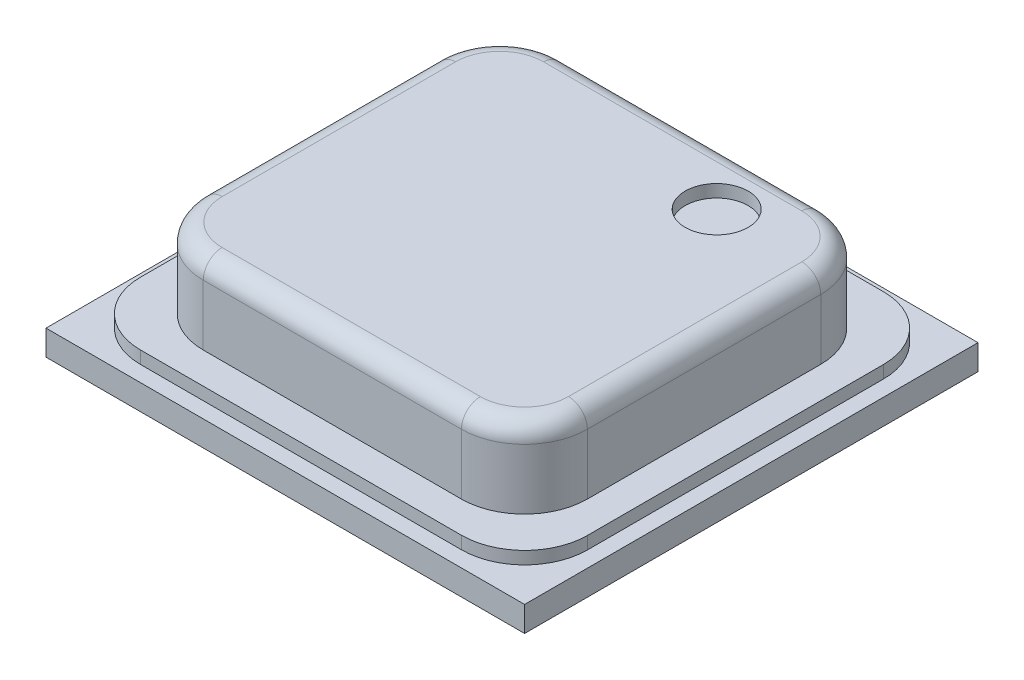
ISO-10303-21;
HEADER;
FILE_DESCRIPTION(('STEP AP214'),'2;1');
FILE_NAME('part.step','',(''),(''),'','','');
FILE_SCHEMA(('AUTOMOTIVE_DESIGN { 1 0 10303 214 1 1 1 1 }'));
ENDSEC;
DATA;
#1=APPLICATION_CONTEXT('core data for automotive mechanical design processes');
#2=APPLICATION_PROTOCOL_DEFINITION('international standard','automotive_design',2000,#1);
#3=PRODUCT_CONTEXT('',#1,'mechanical');
#4=PRODUCT('Part','Part','',(#3));
#5=PRODUCT_RELATED_PRODUCT_CATEGORY('part','',(#4));
#6=PRODUCT_DEFINITION_FORMATION('','',#4);
#7=PRODUCT_DEFINITION_CONTEXT('part definition',#1,'design');
#8=PRODUCT_DEFINITION('design','',#6,#7);
#9=PRODUCT_DEFINITION_SHAPE('','',#8);
#10=(LENGTH_UNIT() NAMED_UNIT(*) SI_UNIT(.MILLI.,.METRE.));
#11=(NAMED_UNIT(*) PLANE_ANGLE_UNIT() SI_UNIT($,.RADIAN.));
#12=(NAMED_UNIT(*) SI_UNIT($,.STERADIAN.) SOLID_ANGLE_UNIT());
#13=UNCERTAINTY_MEASURE_WITH_UNIT(LENGTH_MEASURE(1.E-05),#10,'distance_accuracy_value','');
#14=(GEOMETRIC_REPRESENTATION_CONTEXT(3) GLOBAL_UNCERTAINTY_ASSIGNED_CONTEXT((#13)) GLOBAL_UNIT_ASSIGNED_CONTEXT((#10,
#11,#12)) REPRESENTATION_CONTEXT('',''));
#15=CARTESIAN_POINT('',(0.,0.,0.));
#16=DIRECTION('',(0.,0.,1.));
#17=DIRECTION('',(1.,0.,0.));
#18=AXIS2_PLACEMENT_3D('',#15,#16,#17);
#19=CARTESIAN_POINT('',(0.,0.3,0.));
#20=DIRECTION('',(0.,1.,0.));
#21=DIRECTION('',(0.,0.,1.));
#22=AXIS2_PLACEMENT_3D('',#19,#20,#21);
#23=PLANE('',#22);
#24=DIRECTION('',(1.,0.,0.));
#25=VECTOR('',#24,1.);
#26=CARTESIAN_POINT('',(-1.775,0.3,1.675));
#27=LINE('',#26,#25);
#28=CARTESIAN_POINT('',(-1.275,0.3,1.675));
#29=VERTEX_POINT('',#28);
#30=CARTESIAN_POINT('',(1.275,0.3,1.675));
#31=VERTEX_POINT('',#30);
#32=EDGE_CURVE('E376',#29,#31,#27,.T.);
#33=ORIENTED_EDGE('',*,*,#32,.T.);
#34=CARTESIAN_POINT('',(1.275,0.3,1.175));
#35=DIRECTION('',(0.,1.,0.));
#36=DIRECTION('',(0.,0.,1.));
#37=AXIS2_PLACEMENT_3D('',#34,#35,#36);
#38=CIRCLE('',#37,0.5);
#39=CARTESIAN_POINT('',(1.775,0.3,1.175));
#40=VERTEX_POINT('',#39);
#41=EDGE_CURVE('E245',#31,#40,#38,.T.);
#42=ORIENTED_EDGE('',*,*,#41,.T.);
#43=DIRECTION('',(0.,0.,-1.));
#44=VECTOR('',#43,1.);
#45=CARTESIAN_POINT('',(1.775,0.3,-1.675));
#46=LINE('',#45,#44);
#47=CARTESIAN_POINT('',(1.775,0.3,-1.175));
#48=VERTEX_POINT('',#47);
#49=EDGE_CURVE('E366',#40,#48,#46,.T.);
#50=ORIENTED_EDGE('',*,*,#49,.T.);
#51=CARTESIAN_POINT('',(1.275,0.3,-1.175));
#52=DIRECTION('',(0.,1.,0.));
#53=DIRECTION('',(0.,0.,1.));
#54=AXIS2_PLACEMENT_3D('',#51,#52,#53);
#55=CIRCLE('',#54,0.5);
#56=CARTESIAN_POINT('',(1.275,0.3,-1.675));
#57=VERTEX_POINT('',#56);
#58=EDGE_CURVE('E243',#48,#57,#55,.T.);
#59=ORIENTED_EDGE('',*,*,#58,.T.);
#60=DIRECTION('',(-1.,0.,0.));
#61=VECTOR('',#60,1.);
#62=CARTESIAN_POINT('',(-1.775,0.3,-1.675));
#63=LINE('',#62,#61);
#64=CARTESIAN_POINT('',(-1.275,0.3,-1.675));
#65=VERTEX_POINT('',#64);
#66=EDGE_CURVE('E369',#57,#65,#63,.T.);
#67=ORIENTED_EDGE('',*,*,#66,.T.);
#68=CARTESIAN_POINT('',(-1.275,0.3,-1.175));
#69=DIRECTION('',(0.,1.,0.));
#70=DIRECTION('',(0.,0.,1.));
#71=AXIS2_PLACEMENT_3D('',#68,#69,#70);
#72=CIRCLE('',#71,0.5);
#73=CARTESIAN_POINT('',(-1.775,0.3,-1.175));
#74=VERTEX_POINT('',#73);
#75=EDGE_CURVE('E241',#65,#74,#72,.T.);
#76=ORIENTED_EDGE('',*,*,#75,.T.);
#77=DIRECTION('',(0.,0.,1.));
#78=VECTOR('',#77,1.);
#79=CARTESIAN_POINT('',(-1.775,0.3,-1.675));
#80=LINE('',#79,#78);
#81=CARTESIAN_POINT('',(-1.775,0.3,1.175));
#82=VERTEX_POINT('',#81);
#83=EDGE_CURVE('E373',#74,#82,#80,.T.);
#84=ORIENTED_EDGE('',*,*,#83,.T.);
#85=CARTESIAN_POINT('',(-1.275,0.3,1.175));
#86=DIRECTION('',(0.,1.,0.));
#87=DIRECTION('',(0.,0.,1.));
#88=AXIS2_PLACEMENT_3D('',#85,#86,#87);
#89=CIRCLE('',#88,0.5);
#90=EDGE_CURVE('E239',#82,#29,#89,.T.);
#91=ORIENTED_EDGE('',*,*,#90,.T.);
#92=EDGE_LOOP('',(#33,#42,#50,#59,#67,#76,#84,#91));
#93=FACE_BOUND('',#92,.T.);
#94=DIRECTION('',(-1.,0.,0.));
#95=VECTOR('',#94,1.);
#96=CARTESIAN_POINT('',(-1.525,0.3,-1.4265));
#97=LINE('',#96,#95);
#98=CARTESIAN_POINT('',(1.025,0.3,-1.4265));
#99=VERTEX_POINT('',#98);
#100=CARTESIAN_POINT('',(-1.025,0.3,-1.4265));
#101=VERTEX_POINT('',#100);
#102=EDGE_CURVE('E349',#99,#101,#97,.T.);
#103=ORIENTED_EDGE('',*,*,#102,.F.);
#104=CARTESIAN_POINT('',(1.025,0.3,-0.9265));
#105=DIRECTION('',(0.,1.,0.));
#106=DIRECTION('',(0.,0.,1.));
#107=AXIS2_PLACEMENT_3D('',#104,#105,#106);
#108=CIRCLE('',#107,0.5);
#109=CARTESIAN_POINT('',(1.525,0.3,-0.9265));
#110=VERTEX_POINT('',#109);
#111=EDGE_CURVE('E283',#99,#110,#108,.F.);
#112=ORIENTED_EDGE('',*,*,#111,.T.);
#113=DIRECTION('',(0.,0.,-1.));
#114=VECTOR('',#113,1.);
#115=CARTESIAN_POINT('',(1.525,0.3,-1.4265));
#116=LINE('',#115,#114);
#117=CARTESIAN_POINT('',(1.525,0.3,0.9265));
#118=VERTEX_POINT('',#117);
#119=EDGE_CURVE('E343',#118,#110,#116,.T.);
#120=ORIENTED_EDGE('',*,*,#119,.F.);
#121=CARTESIAN_POINT('',(1.025,0.3,0.9265));
#122=DIRECTION('',(0.,1.,0.));
#123=DIRECTION('',(0.,0.,1.));
#124=AXIS2_PLACEMENT_3D('',#121,#122,#123);
#125=CIRCLE('',#124,0.5);
#126=CARTESIAN_POINT('',(1.025,0.3,1.4265));
#127=VERTEX_POINT('',#126);
#128=EDGE_CURVE('E285',#118,#127,#125,.F.);
#129=ORIENTED_EDGE('',*,*,#128,.T.);
#130=DIRECTION('',(1.,0.,0.));
#131=VECTOR('',#130,1.);
#132=CARTESIAN_POINT('',(-1.525,0.3,1.4265));
#133=LINE('',#132,#131);
#134=CARTESIAN_POINT('',(-1.025,0.3,1.4265));
#135=VERTEX_POINT('',#134);
#136=EDGE_CURVE('E362',#135,#127,#133,.T.);
#137=ORIENTED_EDGE('',*,*,#136,.F.);
#138=CARTESIAN_POINT('',(-1.025,0.3,0.9265));
#139=DIRECTION('',(0.,1.,0.));
#140=DIRECTION('',(0.,0.,1.));
#141=AXIS2_PLACEMENT_3D('',#138,#139,#140);
#142=CIRCLE('',#141,0.5);
#143=CARTESIAN_POINT('',(-1.525,0.3,0.9265));
#144=VERTEX_POINT('',#143);
#145=EDGE_CURVE('E289',#135,#144,#142,.F.);
#146=ORIENTED_EDGE('',*,*,#145,.T.);
#147=DIRECTION('',(0.,0.,1.));
#148=VECTOR('',#147,1.);
#149=CARTESIAN_POINT('',(-1.525,0.3,-1.4265));
#150=LINE('',#149,#148);
#151=CARTESIAN_POINT('',(-1.525,0.3,-0.9265));
#152=VERTEX_POINT('',#151);
#153=EDGE_CURVE('E354',#152,#144,#150,.T.);
#154=ORIENTED_EDGE('',*,*,#153,.F.);
#155=CARTESIAN_POINT('',(-1.025,0.3,-0.9265));
#156=DIRECTION('',(0.,1.,0.));
#157=DIRECTION('',(0.,0.,1.));
#158=AXIS2_PLACEMENT_3D('',#155,#156,#157);
#159=CIRCLE('',#158,0.5);
#160=EDGE_CURVE('E287',#152,#101,#159,.F.);
#161=ORIENTED_EDGE('',*,*,#160,.T.);
#162=EDGE_LOOP('',(#103,#112,#120,#129,#137,#146,#154,#161));
#163=FACE_BOUND('',#162,.T.);
#164=ADVANCED_FACE('F35',(#93,#163),#23,.T.);
#165=CARTESIAN_POINT('',(0.,0.2,0.));
#166=DIRECTION('',(0.,1.,0.));
#167=DIRECTION('',(0.,0.,1.));
#168=AXIS2_PLACEMENT_3D('',#165,#166,#167);
#169=PLANE('',#168);
#170=DIRECTION('',(0.,0.,-1.));
#171=VECTOR('',#170,1.);
#172=CARTESIAN_POINT('',(1.9,0.2,-1.8));
#173=LINE('',#172,#171);
#174=CARTESIAN_POINT('',(1.9,0.2,1.8));
#175=VERTEX_POINT('',#174);
#176=CARTESIAN_POINT('',(1.9,0.2,-1.8));
#177=VERTEX_POINT('',#176);
#178=EDGE_CURVE('E209',#175,#177,#173,.T.);
#179=ORIENTED_EDGE('',*,*,#178,.T.);
#180=DIRECTION('',(-1.,0.,0.));
#181=VECTOR('',#180,1.);
#182=CARTESIAN_POINT('',(-1.9,0.2,-1.8));
#183=LINE('',#182,#181);
#184=CARTESIAN_POINT('',(-1.9,0.2,-1.8));
#185=VERTEX_POINT('',#184);
#186=EDGE_CURVE('E198',#177,#185,#183,.T.);
#187=ORIENTED_EDGE('',*,*,#186,.T.);
#188=DIRECTION('',(0.,0.,1.));
#189=VECTOR('',#188,1.);
#190=CARTESIAN_POINT('',(-1.9,0.2,-1.8));
#191=LINE('',#190,#189);
#192=CARTESIAN_POINT('',(-1.9,0.2,1.8));
#193=VERTEX_POINT('',#192);
#194=EDGE_CURVE('E208',#185,#193,#191,.T.);
#195=ORIENTED_EDGE('',*,*,#194,.T.);
#196=DIRECTION('',(1.,0.,0.));
#197=VECTOR('',#196,1.);
#198=CARTESIAN_POINT('',(-1.9,0.2,1.8));
#199=LINE('',#198,#197);
#200=EDGE_CURVE('E215',#193,#175,#199,.T.);
#201=ORIENTED_EDGE('',*,*,#200,.T.);
#202=EDGE_LOOP('',(#179,#187,#195,#201));
#203=FACE_BOUND('',#202,.T.);
#204=DIRECTION('',(-1.,0.,0.));
#205=VECTOR('',#204,1.);
#206=CARTESIAN_POINT('',(-1.775,0.2,-1.675));
#207=LINE('',#206,#205);
#208=CARTESIAN_POINT('',(1.275,0.2,-1.675));
#209=VERTEX_POINT('',#208);
#210=CARTESIAN_POINT('',(-1.275,0.2,-1.675));
#211=VERTEX_POINT('',#210);
#212=EDGE_CURVE('E381',#209,#211,#207,.T.);
#213=ORIENTED_EDGE('',*,*,#212,.F.);
#214=CARTESIAN_POINT('',(1.275,0.2,-1.175));
#215=DIRECTION('',(0.,1.,0.));
#216=DIRECTION('',(0.,0.,1.));
#217=AXIS2_PLACEMENT_3D('',#214,#215,#216);
#218=CIRCLE('',#217,0.5);
#219=CARTESIAN_POINT('',(1.775,0.2,-1.175));
#220=VERTEX_POINT('',#219);
#221=EDGE_CURVE('E259',#209,#220,#218,.F.);
#222=ORIENTED_EDGE('',*,*,#221,.T.);
#223=DIRECTION('',(0.,0.,-1.));
#224=VECTOR('',#223,1.);
#225=CARTESIAN_POINT('',(1.775,0.2,-1.675));
#226=LINE('',#225,#224);
#227=CARTESIAN_POINT('',(1.775,0.2,1.175));
#228=VERTEX_POINT('',#227);
#229=EDGE_CURVE('E365',#228,#220,#226,.T.);
#230=ORIENTED_EDGE('',*,*,#229,.F.);
#231=CARTESIAN_POINT('',(1.275,0.2,1.175));
#232=DIRECTION('',(0.,1.,0.));
#233=DIRECTION('',(0.,0.,1.));
#234=AXIS2_PLACEMENT_3D('',#231,#232,#233);
#235=CIRCLE('',#234,0.5);
#236=CARTESIAN_POINT('',(1.275,0.2,1.675));
#237=VERTEX_POINT('',#236);
#238=EDGE_CURVE('E257',#228,#237,#235,.F.);
#239=ORIENTED_EDGE('',*,*,#238,.T.);
#240=DIRECTION('',(1.,0.,0.));
#241=VECTOR('',#240,1.);
#242=CARTESIAN_POINT('',(-1.775,0.2,1.675));
#243=LINE('',#242,#241);
#244=CARTESIAN_POINT('',(-1.275,0.2,1.675));
#245=VERTEX_POINT('',#244);
#246=EDGE_CURVE('E370',#245,#237,#243,.T.);
#247=ORIENTED_EDGE('',*,*,#246,.F.);
#248=CARTESIAN_POINT('',(-1.275,0.2,1.175));
#249=DIRECTION('',(0.,1.,0.));
#250=DIRECTION('',(0.,0.,1.));
#251=AXIS2_PLACEMENT_3D('',#248,#249,#250);
#252=CIRCLE('',#251,0.5);
#253=CARTESIAN_POINT('',(-1.775,0.2,1.175));
#254=VERTEX_POINT('',#253);
#255=EDGE_CURVE('E263',#245,#254,#252,.F.);
#256=ORIENTED_EDGE('',*,*,#255,.T.);
#257=DIRECTION('',(0.,0.,1.));
#258=VECTOR('',#257,1.);
#259=CARTESIAN_POINT('',(-1.775,0.2,-1.675));
#260=LINE('',#259,#258);
#261=CARTESIAN_POINT('',(-1.775,0.2,-1.175));
#262=VERTEX_POINT('',#261);
#263=EDGE_CURVE('E384',#262,#254,#260,.T.);
#264=ORIENTED_EDGE('',*,*,#263,.F.);
#265=CARTESIAN_POINT('',(-1.275,0.2,-1.175));
#266=DIRECTION('',(0.,1.,0.));
#267=DIRECTION('',(0.,0.,1.));
#268=AXIS2_PLACEMENT_3D('',#265,#266,#267);
#269=CIRCLE('',#268,0.5);
#270=EDGE_CURVE('E261',#262,#211,#269,.F.);
#271=ORIENTED_EDGE('',*,*,#270,.T.);
#272=EDGE_LOOP('',(#213,#222,#230,#239,#247,#256,#264,#271));
#273=FACE_BOUND('',#272,.T.);
#274=ADVANCED_FACE('F212',(#203,#273),#169,.T.);
#275=CARTESIAN_POINT('',(1.9,0.2,-1.8));
#276=DIRECTION('',(-1.,0.,0.));
#277=DIRECTION('',(0.,0.,1.));
#278=AXIS2_PLACEMENT_3D('',#275,#276,#277);
#279=PLANE('',#278);
#280=DIRECTION('',(0.,0.,-1.));
#281=VECTOR('',#280,1.);
#282=CARTESIAN_POINT('',(1.9,0.,-1.8));
#283=LINE('',#282,#281);
#284=CARTESIAN_POINT('',(1.9,0.,1.8));
#285=VERTEX_POINT('',#284);
#286=CARTESIAN_POINT('',(1.9,0.,-1.8));
#287=VERTEX_POINT('',#286);
#288=EDGE_CURVE('E223',#285,#287,#283,.T.);
#289=ORIENTED_EDGE('',*,*,#288,.T.);
#290=DIRECTION('',(0.,-1.,0.));
#291=VECTOR('',#290,1.);
#292=CARTESIAN_POINT('',(1.9,0.2,-1.8));
#293=LINE('',#292,#291);
#294=EDGE_CURVE('E202',#177,#287,#293,.T.);
#295=ORIENTED_EDGE('',*,*,#294,.F.);
#296=ORIENTED_EDGE('',*,*,#178,.F.);
#297=DIRECTION('',(0.,-1.,0.));
#298=VECTOR('',#297,1.);
#299=CARTESIAN_POINT('',(1.9,0.2,1.8));
#300=LINE('',#299,#298);
#301=EDGE_CURVE('E391',#175,#285,#300,.T.);
#302=ORIENTED_EDGE('',*,*,#301,.T.);
#303=EDGE_LOOP('',(#289,#295,#296,#302));
#304=FACE_BOUND('',#303,.T.);
#305=ADVANCED_FACE('F221',(#304),#279,.F.);
#306=CARTESIAN_POINT('',(-1.9,0.2,-1.8));
#307=DIRECTION('',(0.,0.,1.));
#308=DIRECTION('',(1.,0.,0.));
#309=AXIS2_PLACEMENT_3D('',#306,#307,#308);
#310=PLANE('',#309);
#311=DIRECTION('',(-1.,0.,0.));
#312=VECTOR('',#311,1.);
#313=CARTESIAN_POINT('',(-1.9,0.,-1.8));
#314=LINE('',#313,#312);
#315=CARTESIAN_POINT('',(-1.9,0.,-1.8));
#316=VERTEX_POINT('',#315);
#317=EDGE_CURVE('E393',#287,#316,#314,.T.);
#318=ORIENTED_EDGE('',*,*,#317,.T.);
#319=DIRECTION('',(0.,-1.,0.));
#320=VECTOR('',#319,1.);
#321=CARTESIAN_POINT('',(-1.9,0.2,-1.8));
#322=LINE('',#321,#320);
#323=EDGE_CURVE('E205',#185,#316,#322,.T.);
#324=ORIENTED_EDGE('',*,*,#323,.F.);
#325=ORIENTED_EDGE('',*,*,#186,.F.);
#326=ORIENTED_EDGE('',*,*,#294,.T.);
#327=EDGE_LOOP('',(#318,#324,#325,#326));
#328=FACE_BOUND('',#327,.T.);
#329=ADVANCED_FACE('F200',(#328),#310,.F.);
#330=CARTESIAN_POINT('',(-1.9,0.2,-1.8));
#331=DIRECTION('',(1.,0.,0.));
#332=DIRECTION('',(0.,0.,-1.));
#333=AXIS2_PLACEMENT_3D('',#330,#331,#332);
#334=PLANE('',#333);
#335=DIRECTION('',(0.,0.,1.));
#336=VECTOR('',#335,1.);
#337=CARTESIAN_POINT('',(-1.9,0.,-1.8));
#338=LINE('',#337,#336);
#339=CARTESIAN_POINT('',(-1.9,0.,1.8));
#340=VERTEX_POINT('',#339);
#341=EDGE_CURVE('E395',#316,#340,#338,.T.);
#342=ORIENTED_EDGE('',*,*,#341,.T.);
#343=DIRECTION('',(0.,-1.,0.));
#344=VECTOR('',#343,1.);
#345=CARTESIAN_POINT('',(-1.9,0.2,1.8));
#346=LINE('',#345,#344);
#347=EDGE_CURVE('E228',#193,#340,#346,.T.);
#348=ORIENTED_EDGE('',*,*,#347,.F.);
#349=ORIENTED_EDGE('',*,*,#194,.F.);
#350=ORIENTED_EDGE('',*,*,#323,.T.);
#351=EDGE_LOOP('',(#342,#348,#349,#350));
#352=FACE_BOUND('',#351,.T.);
#353=ADVANCED_FACE('F407',(#352),#334,.F.);
#354=CARTESIAN_POINT('',(-1.9,0.2,1.8));
#355=DIRECTION('',(0.,0.,-1.));
#356=DIRECTION('',(-1.,0.,0.));
#357=AXIS2_PLACEMENT_3D('',#354,#355,#356);
#358=PLANE('',#357);
#359=DIRECTION('',(1.,0.,0.));
#360=VECTOR('',#359,1.);
#361=CARTESIAN_POINT('',(-1.9,0.,1.8));
#362=LINE('',#361,#360);
#363=EDGE_CURVE('E219',#340,#285,#362,.T.);
#364=ORIENTED_EDGE('',*,*,#363,.T.);
#365=ORIENTED_EDGE('',*,*,#301,.F.);
#366=ORIENTED_EDGE('',*,*,#200,.F.);
#367=ORIENTED_EDGE('',*,*,#347,.T.);
#368=EDGE_LOOP('',(#364,#365,#366,#367));
#369=FACE_BOUND('',#368,.T.);
#370=ADVANCED_FACE('F402',(#369),#358,.F.);
#371=CARTESIAN_POINT('',(0.,0.,0.));
#372=DIRECTION('',(0.,1.,0.));
#373=DIRECTION('',(0.,0.,1.));
#374=AXIS2_PLACEMENT_3D('',#371,#372,#373);
#375=PLANE('',#374);
#376=ORIENTED_EDGE('',*,*,#288,.F.);
#377=ORIENTED_EDGE('',*,*,#363,.F.);
#378=ORIENTED_EDGE('',*,*,#341,.F.);
#379=ORIENTED_EDGE('',*,*,#317,.F.);
#380=EDGE_LOOP('',(#376,#377,#378,#379));
#381=FACE_BOUND('',#380,.T.);
#382=ADVANCED_FACE('F406',(#381),#375,.F.);
#383=CARTESIAN_POINT('',(1.775,0.3,-1.675));
#384=DIRECTION('',(-1.,0.,0.));
#385=DIRECTION('',(0.,0.,1.));
#386=AXIS2_PLACEMENT_3D('',#383,#384,#385);
#387=PLANE('',#386);
#388=ORIENTED_EDGE('',*,*,#49,.F.);
#389=DIRECTION('',(0.,-1.,0.));
#390=VECTOR('',#389,1.);
#391=CARTESIAN_POINT('',(1.775,0.3,1.175));
#392=LINE('',#391,#390);
#393=EDGE_CURVE('E226',#40,#228,#392,.T.);
#394=ORIENTED_EDGE('',*,*,#393,.T.);
#395=ORIENTED_EDGE('',*,*,#229,.T.);
#396=DIRECTION('',(0.,-1.,0.));
#397=VECTOR('',#396,1.);
#398=CARTESIAN_POINT('',(1.775,0.3,-1.175));
#399=LINE('',#398,#397);
#400=EDGE_CURVE('E224',#220,#48,#399,.F.);
#401=ORIENTED_EDGE('',*,*,#400,.T.);
#402=EDGE_LOOP('',(#388,#394,#395,#401));
#403=FACE_BOUND('',#402,.T.);
#404=ADVANCED_FACE('F440',(#403),#387,.F.);
#405=CARTESIAN_POINT('',(-1.775,0.3,-1.675));
#406=DIRECTION('',(0.,0.,1.));
#407=DIRECTION('',(1.,0.,0.));
#408=AXIS2_PLACEMENT_3D('',#405,#406,#407);
#409=PLANE('',#408);
#410=ORIENTED_EDGE('',*,*,#66,.F.);
#411=DIRECTION('',(0.,-1.,0.));
#412=VECTOR('',#411,1.);
#413=CARTESIAN_POINT('',(1.275,0.3,-1.675));
#414=LINE('',#413,#412);
#415=EDGE_CURVE('E249',#57,#209,#414,.T.);
#416=ORIENTED_EDGE('',*,*,#415,.T.);
#417=ORIENTED_EDGE('',*,*,#212,.T.);
#418=DIRECTION('',(0.,-1.,0.));
#419=VECTOR('',#418,1.);
#420=CARTESIAN_POINT('',(-1.275,0.3,-1.675));
#421=LINE('',#420,#419);
#422=EDGE_CURVE('E247',#211,#65,#421,.F.);
#423=ORIENTED_EDGE('',*,*,#422,.T.);
#424=EDGE_LOOP('',(#410,#416,#417,#423));
#425=FACE_BOUND('',#424,.T.);
#426=ADVANCED_FACE('F436',(#425),#409,.F.);
#427=CARTESIAN_POINT('',(-1.775,0.3,-1.675));
#428=DIRECTION('',(1.,0.,0.));
#429=DIRECTION('',(0.,0.,-1.));
#430=AXIS2_PLACEMENT_3D('',#427,#428,#429);
#431=PLANE('',#430);
#432=ORIENTED_EDGE('',*,*,#83,.F.);
#433=DIRECTION('',(0.,-1.,0.));
#434=VECTOR('',#433,1.);
#435=CARTESIAN_POINT('',(-1.775,0.3,-1.175));
#436=LINE('',#435,#434);
#437=EDGE_CURVE('E254',#74,#262,#436,.T.);
#438=ORIENTED_EDGE('',*,*,#437,.T.);
#439=ORIENTED_EDGE('',*,*,#263,.T.);
#440=DIRECTION('',(0.,-1.,0.));
#441=VECTOR('',#440,1.);
#442=CARTESIAN_POINT('',(-1.775,0.3,1.175));
#443=LINE('',#442,#441);
#444=EDGE_CURVE('E252',#254,#82,#443,.F.);
#445=ORIENTED_EDGE('',*,*,#444,.T.);
#446=EDGE_LOOP('',(#432,#438,#439,#445));
#447=FACE_BOUND('',#446,.T.);
#448=ADVANCED_FACE('F432',(#447),#431,.F.);
#449=CARTESIAN_POINT('',(-1.775,0.3,1.675));
#450=DIRECTION('',(0.,0.,-1.));
#451=DIRECTION('',(-1.,0.,0.));
#452=AXIS2_PLACEMENT_3D('',#449,#450,#451);
#453=PLANE('',#452);
#454=ORIENTED_EDGE('',*,*,#246,.T.);
#455=DIRECTION('',(0.,-1.,0.));
#456=VECTOR('',#455,1.);
#457=CARTESIAN_POINT('',(1.275,0.3,1.675));
#458=LINE('',#457,#456);
#459=EDGE_CURVE('E237',#237,#31,#458,.F.);
#460=ORIENTED_EDGE('',*,*,#459,.T.);
#461=ORIENTED_EDGE('',*,*,#32,.F.);
#462=DIRECTION('',(0.,-1.,0.));
#463=VECTOR('',#462,1.);
#464=CARTESIAN_POINT('',(-1.275,0.3,1.675));
#465=LINE('',#464,#463);
#466=EDGE_CURVE('E234',#29,#245,#465,.T.);
#467=ORIENTED_EDGE('',*,*,#466,.T.);
#468=EDGE_LOOP('',(#454,#460,#461,#467));
#469=FACE_BOUND('',#468,.T.);
#470=ADVANCED_FACE('F428',(#469),#453,.F.);
#471=CARTESIAN_POINT('',(1.275,0.3,1.175));
#472=DIRECTION('',(0.,-1.,0.));
#473=DIRECTION('',(0.,0.,-1.));
#474=AXIS2_PLACEMENT_3D('',#471,#472,#473);
#475=CYLINDRICAL_SURFACE('',#474,0.5);
#476=ORIENTED_EDGE('',*,*,#41,.F.);
#477=ORIENTED_EDGE('',*,*,#459,.F.);
#478=ORIENTED_EDGE('',*,*,#238,.F.);
#479=ORIENTED_EDGE('',*,*,#393,.F.);
#480=EDGE_LOOP('',(#476,#477,#478,#479));
#481=FACE_BOUND('',#480,.T.);
#482=ADVANCED_FACE('F431',(#481),#475,.T.);
#483=CARTESIAN_POINT('',(1.275,0.3,-1.175));
#484=DIRECTION('',(0.,-1.,0.));
#485=DIRECTION('',(0.,0.,-1.));
#486=AXIS2_PLACEMENT_3D('',#483,#484,#485);
#487=CYLINDRICAL_SURFACE('',#486,0.5);
#488=ORIENTED_EDGE('',*,*,#58,.F.);
#489=ORIENTED_EDGE('',*,*,#400,.F.);
#490=ORIENTED_EDGE('',*,*,#221,.F.);
#491=ORIENTED_EDGE('',*,*,#415,.F.);
#492=EDGE_LOOP('',(#488,#489,#490,#491));
#493=FACE_BOUND('',#492,.T.);
#494=ADVANCED_FACE('F473',(#493),#487,.T.);
#495=CARTESIAN_POINT('',(-1.275,0.3,-1.175));
#496=DIRECTION('',(0.,-1.,0.));
#497=DIRECTION('',(0.,0.,-1.));
#498=AXIS2_PLACEMENT_3D('',#495,#496,#497);
#499=CYLINDRICAL_SURFACE('',#498,0.5);
#500=ORIENTED_EDGE('',*,*,#75,.F.);
#501=ORIENTED_EDGE('',*,*,#422,.F.);
#502=ORIENTED_EDGE('',*,*,#270,.F.);
#503=ORIENTED_EDGE('',*,*,#437,.F.);
#504=EDGE_LOOP('',(#500,#501,#502,#503));
#505=FACE_BOUND('',#504,.T.);
#506=ADVANCED_FACE('F481',(#505),#499,.T.);
#507=CARTESIAN_POINT('',(-1.275,0.3,1.175));
#508=DIRECTION('',(0.,-1.,0.));
#509=DIRECTION('',(0.,0.,-1.));
#510=AXIS2_PLACEMENT_3D('',#507,#508,#509);
#511=CYLINDRICAL_SURFACE('',#510,0.5);
#512=ORIENTED_EDGE('',*,*,#90,.F.);
#513=ORIENTED_EDGE('',*,*,#444,.F.);
#514=ORIENTED_EDGE('',*,*,#255,.F.);
#515=ORIENTED_EDGE('',*,*,#466,.F.);
#516=EDGE_LOOP('',(#512,#513,#514,#515));
#517=FACE_BOUND('',#516,.T.);
#518=ADVANCED_FACE('F489',(#517),#511,.T.);
#519=CARTESIAN_POINT('',(1.525,0.93,-1.4265));
#520=DIRECTION('',(-1.,0.,0.));
#521=DIRECTION('',(0.,0.,1.));
#522=AXIS2_PLACEMENT_3D('',#519,#520,#521);
#523=PLANE('',#522);
#524=DIRECTION('',(0.,-1.,0.));
#525=VECTOR('',#524,1.);
#526=CARTESIAN_POINT('',(1.525,0.93,-0.9265));
#527=LINE('',#526,#525);
#528=CARTESIAN_POINT('',(1.525,0.78,-0.9265));
#529=VERTEX_POINT('',#528);
#530=EDGE_CURVE('E271',#110,#529,#527,.F.);
#531=ORIENTED_EDGE('',*,*,#530,.T.);
#532=DIRECTION('',(0.,0.,-1.));
#533=VECTOR('',#532,1.);
#534=CARTESIAN_POINT('',(1.525,0.78,0.9265));
#535=LINE('',#534,#533);
#536=CARTESIAN_POINT('',(1.525,0.78,0.9265));
#537=VERTEX_POINT('',#536);
#538=EDGE_CURVE('E11',#529,#537,#535,.F.);
#539=ORIENTED_EDGE('',*,*,#538,.T.);
#540=DIRECTION('',(0.,-1.,0.));
#541=VECTOR('',#540,1.);
#542=CARTESIAN_POINT('',(1.525,0.93,0.9265));
#543=LINE('',#542,#541);
#544=EDGE_CURVE('E269',#537,#118,#543,.T.);
#545=ORIENTED_EDGE('',*,*,#544,.T.);
#546=ORIENTED_EDGE('',*,*,#119,.T.);
#547=EDGE_LOOP('',(#531,#539,#545,#546));
#548=FACE_BOUND('',#547,.T.);
#549=ADVANCED_FACE('F426',(#548),#523,.F.);
#550=CARTESIAN_POINT('',(-1.525,0.93,-1.4265));
#551=DIRECTION('',(0.,0.,1.));
#552=DIRECTION('',(1.,0.,0.));
#553=AXIS2_PLACEMENT_3D('',#550,#551,#552);
#554=PLANE('',#553);
#555=DIRECTION('',(0.,-1.,0.));
#556=VECTOR('',#555,1.);
#557=CARTESIAN_POINT('',(-1.025,0.93,-1.4265));
#558=LINE('',#557,#556);
#559=CARTESIAN_POINT('',(-1.025,0.78,-1.4265));
#560=VERTEX_POINT('',#559);
#561=EDGE_CURVE('E265',#101,#560,#558,.F.);
#562=ORIENTED_EDGE('',*,*,#561,.T.);
#563=DIRECTION('',(-1.,0.,0.));
#564=VECTOR('',#563,1.);
#565=CARTESIAN_POINT('',(1.025,0.78,-1.4265));
#566=LINE('',#565,#564);
#567=CARTESIAN_POINT('',(1.025,0.78,-1.4265));
#568=VERTEX_POINT('',#567);
#569=EDGE_CURVE('E59',#560,#568,#566,.F.);
#570=ORIENTED_EDGE('',*,*,#569,.T.);
#571=DIRECTION('',(0.,-1.,0.));
#572=VECTOR('',#571,1.);
#573=CARTESIAN_POINT('',(1.025,0.93,-1.4265));
#574=LINE('',#573,#572);
#575=EDGE_CURVE('E267',#568,#99,#574,.T.);
#576=ORIENTED_EDGE('',*,*,#575,.T.);
#577=ORIENTED_EDGE('',*,*,#102,.T.);
#578=EDGE_LOOP('',(#562,#570,#576,#577));
#579=FACE_BOUND('',#578,.T.);
#580=ADVANCED_FACE('F504',(#579),#554,.F.);
#581=CARTESIAN_POINT('',(-1.525,0.93,-1.4265));
#582=DIRECTION('',(1.,0.,0.));
#583=DIRECTION('',(0.,0.,-1.));
#584=AXIS2_PLACEMENT_3D('',#581,#582,#583);
#585=PLANE('',#584);
#586=DIRECTION('',(0.,-1.,0.));
#587=VECTOR('',#586,1.);
#588=CARTESIAN_POINT('',(-1.525,0.93,0.9265));
#589=LINE('',#588,#587);
#590=CARTESIAN_POINT('',(-1.525,0.78,0.9265));
#591=VERTEX_POINT('',#590);
#592=EDGE_CURVE('E278',#144,#591,#589,.F.);
#593=ORIENTED_EDGE('',*,*,#592,.T.);
#594=DIRECTION('',(0.,0.,1.));
#595=VECTOR('',#594,1.);
#596=CARTESIAN_POINT('',(-1.525,0.78,-0.9265));
#597=LINE('',#596,#595);
#598=CARTESIAN_POINT('',(-1.525,0.78,-0.9265));
#599=VERTEX_POINT('',#598);
#600=EDGE_CURVE('E315',#591,#599,#597,.F.);
#601=ORIENTED_EDGE('',*,*,#600,.T.);
#602=DIRECTION('',(0.,-1.,0.));
#603=VECTOR('',#602,1.);
#604=CARTESIAN_POINT('',(-1.525,0.93,-0.9265));
#605=LINE('',#604,#603);
#606=EDGE_CURVE('E281',#599,#152,#605,.T.);
#607=ORIENTED_EDGE('',*,*,#606,.T.);
#608=ORIENTED_EDGE('',*,*,#153,.T.);
#609=EDGE_LOOP('',(#593,#601,#607,#608));
#610=FACE_BOUND('',#609,.T.);
#611=ADVANCED_FACE('F510',(#610),#585,.F.);
#612=CARTESIAN_POINT('',(-1.525,0.93,1.4265));
#613=DIRECTION('',(0.,0.,-1.));
#614=DIRECTION('',(-1.,0.,0.));
#615=AXIS2_PLACEMENT_3D('',#612,#613,#614);
#616=PLANE('',#615);
#617=DIRECTION('',(0.,-1.,0.));
#618=VECTOR('',#617,1.);
#619=CARTESIAN_POINT('',(1.025,0.93,1.4265));
#620=LINE('',#619,#618);
#621=CARTESIAN_POINT('',(1.025,0.78,1.4265));
#622=VERTEX_POINT('',#621);
#623=EDGE_CURVE('E275',#127,#622,#620,.F.);
#624=ORIENTED_EDGE('',*,*,#623,.T.);
#625=DIRECTION('',(1.,0.,0.));
#626=VECTOR('',#625,1.);
#627=CARTESIAN_POINT('',(-1.025,0.78,1.4265));
#628=LINE('',#627,#626);
#629=CARTESIAN_POINT('',(-1.025,0.78,1.4265));
#630=VERTEX_POINT('',#629);
#631=EDGE_CURVE('E311',#622,#630,#628,.F.);
#632=ORIENTED_EDGE('',*,*,#631,.T.);
#633=DIRECTION('',(0.,-1.,0.));
#634=VECTOR('',#633,1.);
#635=CARTESIAN_POINT('',(-1.025,0.93,1.4265));
#636=LINE('',#635,#634);
#637=EDGE_CURVE('E273',#630,#135,#636,.T.);
#638=ORIENTED_EDGE('',*,*,#637,.T.);
#639=ORIENTED_EDGE('',*,*,#136,.T.);
#640=EDGE_LOOP('',(#624,#632,#638,#639));
#641=FACE_BOUND('',#640,.T.);
#642=ADVANCED_FACE('F516',(#641),#616,.F.);
#643=CARTESIAN_POINT('',(0.,0.93,0.));
#644=DIRECTION('',(0.,1.,0.));
#645=DIRECTION('',(0.,0.,1.));
#646=AXIS2_PLACEMENT_3D('',#643,#644,#645);
#647=PLANE('',#646);
#648=CARTESIAN_POINT('',(0.675,0.93,-0.95));
#649=DIRECTION('',(0.,1.,0.));
#650=DIRECTION('',(0.,0.,1.));
#651=AXIS2_PLACEMENT_3D('',#648,#649,#650);
#652=CIRCLE('',#651,0.25);
#653=CARTESIAN_POINT('',(0.675,0.93,-0.7));
#654=VERTEX_POINT('',#653);
#655=EDGE_CURVE('E357',#654,#654,#652,.T.);
#656=ORIENTED_EDGE('',*,*,#655,.F.);
#657=EDGE_LOOP('',(#656));
#658=FACE_BOUND('',#657,.T.);
#659=DIRECTION('',(1.,0.,0.));
#660=VECTOR('',#659,1.);
#661=CARTESIAN_POINT('',(1.025,0.93,1.2765));
#662=LINE('',#661,#660);
#663=CARTESIAN_POINT('',(-1.025,0.93,1.2765));
#664=VERTEX_POINT('',#663);
#665=CARTESIAN_POINT('',(1.025,0.93,1.2765));
#666=VERTEX_POINT('',#665);
#667=EDGE_CURVE('E303',#664,#666,#662,.T.);
#668=ORIENTED_EDGE('',*,*,#667,.T.);
#669=CARTESIAN_POINT('',(1.025,0.93,0.9265));
#670=DIRECTION('',(0.,1.,0.));
#671=DIRECTION('',(0.,0.,1.));
#672=AXIS2_PLACEMENT_3D('',#669,#670,#671);
#673=CIRCLE('',#672,0.35);
#674=CARTESIAN_POINT('',(1.375,0.93,0.9265));
#675=VERTEX_POINT('',#674);
#676=EDGE_CURVE('E305',#666,#675,#673,.T.);
#677=ORIENTED_EDGE('',*,*,#676,.T.);
#678=DIRECTION('',(0.,0.,-1.));
#679=VECTOR('',#678,1.);
#680=CARTESIAN_POINT('',(1.375,0.93,-0.9265));
#681=LINE('',#680,#679);
#682=CARTESIAN_POINT('',(1.375,0.93,-0.9265));
#683=VERTEX_POINT('',#682);
#684=EDGE_CURVE('E291',#675,#683,#681,.T.);
#685=ORIENTED_EDGE('',*,*,#684,.T.);
#686=CARTESIAN_POINT('',(1.025,0.93,-0.9265));
#687=DIRECTION('',(0.,1.,0.));
#688=DIRECTION('',(0.,0.,1.));
#689=AXIS2_PLACEMENT_3D('',#686,#687,#688);
#690=CIRCLE('',#689,0.35);
#691=CARTESIAN_POINT('',(1.025,0.93,-1.2765));
#692=VERTEX_POINT('',#691);
#693=EDGE_CURVE('E293',#683,#692,#690,.T.);
#694=ORIENTED_EDGE('',*,*,#693,.T.);
#695=DIRECTION('',(-1.,0.,0.));
#696=VECTOR('',#695,1.);
#697=CARTESIAN_POINT('',(-1.025,0.93,-1.2765));
#698=LINE('',#697,#696);
#699=CARTESIAN_POINT('',(-1.025,0.93,-1.2765));
#700=VERTEX_POINT('',#699);
#701=EDGE_CURVE('E295',#692,#700,#698,.T.);
#702=ORIENTED_EDGE('',*,*,#701,.T.);
#703=CARTESIAN_POINT('',(-1.025,0.93,-0.9265));
#704=DIRECTION('',(0.,1.,0.));
#705=DIRECTION('',(0.,0.,1.));
#706=AXIS2_PLACEMENT_3D('',#703,#704,#705);
#707=CIRCLE('',#706,0.35);
#708=CARTESIAN_POINT('',(-1.375,0.93,-0.9265));
#709=VERTEX_POINT('',#708);
#710=EDGE_CURVE('E297',#700,#709,#707,.T.);
#711=ORIENTED_EDGE('',*,*,#710,.T.);
#712=DIRECTION('',(0.,0.,1.));
#713=VECTOR('',#712,1.);
#714=CARTESIAN_POINT('',(-1.375,0.93,0.9265));
#715=LINE('',#714,#713);
#716=CARTESIAN_POINT('',(-1.375,0.93,0.9265));
#717=VERTEX_POINT('',#716);
#718=EDGE_CURVE('E299',#709,#717,#715,.T.);
#719=ORIENTED_EDGE('',*,*,#718,.T.);
#720=CARTESIAN_POINT('',(-1.025,0.93,0.9265));
#721=DIRECTION('',(0.,1.,0.));
#722=DIRECTION('',(0.,0.,1.));
#723=AXIS2_PLACEMENT_3D('',#720,#721,#722);
#724=CIRCLE('',#723,0.35);
#725=EDGE_CURVE('E301',#717,#664,#724,.T.);
#726=ORIENTED_EDGE('',*,*,#725,.T.);
#727=EDGE_LOOP('',(#668,#677,#685,#694,#702,#711,#719,#726));
#728=FACE_BOUND('',#727,.T.);
#729=ADVANCED_FACE('F524',(#658,#728),#647,.T.);
#730=CARTESIAN_POINT('',(1.025,0.93,-0.9265));
#731=DIRECTION('',(0.,-1.,0.));
#732=DIRECTION('',(0.,0.,-1.));
#733=AXIS2_PLACEMENT_3D('',#730,#731,#732);
#734=CYLINDRICAL_SURFACE('',#733,0.5);
#735=ORIENTED_EDGE('',*,*,#575,.F.);
#736=CARTESIAN_POINT('',(1.025,0.78,-0.9265));
#737=DIRECTION('',(0.,1.,0.));
#738=DIRECTION('',(0.,0.,1.));
#739=AXIS2_PLACEMENT_3D('',#736,#737,#738);
#740=CIRCLE('',#739,0.5);
#741=EDGE_CURVE('E44',#568,#529,#740,.F.);
#742=ORIENTED_EDGE('',*,*,#741,.T.);
#743=ORIENTED_EDGE('',*,*,#530,.F.);
#744=ORIENTED_EDGE('',*,*,#111,.F.);
#745=EDGE_LOOP('',(#735,#742,#743,#744));
#746=FACE_BOUND('',#745,.T.);
#747=ADVANCED_FACE('F533',(#746),#734,.T.);
#748=CARTESIAN_POINT('',(1.025,0.93,0.9265));
#749=DIRECTION('',(0.,-1.,0.));
#750=DIRECTION('',(0.,0.,-1.));
#751=AXIS2_PLACEMENT_3D('',#748,#749,#750);
#752=CYLINDRICAL_SURFACE('',#751,0.5);
#753=ORIENTED_EDGE('',*,*,#544,.F.);
#754=CARTESIAN_POINT('',(1.025,0.78,0.9265));
#755=DIRECTION('',(0.,1.,0.));
#756=DIRECTION('',(0.,0.,1.));
#757=AXIS2_PLACEMENT_3D('',#754,#755,#756);
#758=CIRCLE('',#757,0.5);
#759=EDGE_CURVE('E308',#537,#622,#758,.F.);
#760=ORIENTED_EDGE('',*,*,#759,.T.);
#761=ORIENTED_EDGE('',*,*,#623,.F.);
#762=ORIENTED_EDGE('',*,*,#128,.F.);
#763=EDGE_LOOP('',(#753,#760,#761,#762));
#764=FACE_BOUND('',#763,.T.);
#765=ADVANCED_FACE('F542',(#764),#752,.T.);
#766=CARTESIAN_POINT('',(-1.025,0.93,-0.9265));
#767=DIRECTION('',(0.,-1.,0.));
#768=DIRECTION('',(0.,0.,-1.));
#769=AXIS2_PLACEMENT_3D('',#766,#767,#768);
#770=CYLINDRICAL_SURFACE('',#769,0.5);
#771=ORIENTED_EDGE('',*,*,#606,.F.);
#772=CARTESIAN_POINT('',(-1.025,0.78,-0.9265));
#773=DIRECTION('',(0.,1.,0.));
#774=DIRECTION('',(0.,0.,1.));
#775=AXIS2_PLACEMENT_3D('',#772,#773,#774);
#776=CIRCLE('',#775,0.5);
#777=EDGE_CURVE('E317',#599,#560,#776,.F.);
#778=ORIENTED_EDGE('',*,*,#777,.T.);
#779=ORIENTED_EDGE('',*,*,#561,.F.);
#780=ORIENTED_EDGE('',*,*,#160,.F.);
#781=EDGE_LOOP('',(#771,#778,#779,#780));
#782=FACE_BOUND('',#781,.T.);
#783=ADVANCED_FACE('F549',(#782),#770,.T.);
#784=CARTESIAN_POINT('',(-1.025,0.93,0.9265));
#785=DIRECTION('',(0.,-1.,0.));
#786=DIRECTION('',(0.,0.,-1.));
#787=AXIS2_PLACEMENT_3D('',#784,#785,#786);
#788=CYLINDRICAL_SURFACE('',#787,0.5);
#789=ORIENTED_EDGE('',*,*,#637,.F.);
#790=CARTESIAN_POINT('',(-1.025,0.78,0.9265));
#791=DIRECTION('',(0.,1.,0.));
#792=DIRECTION('',(0.,0.,1.));
#793=AXIS2_PLACEMENT_3D('',#790,#791,#792);
#794=CIRCLE('',#793,0.5);
#795=EDGE_CURVE('E313',#630,#591,#794,.F.);
#796=ORIENTED_EDGE('',*,*,#795,.T.);
#797=ORIENTED_EDGE('',*,*,#592,.F.);
#798=ORIENTED_EDGE('',*,*,#145,.F.);
#799=EDGE_LOOP('',(#789,#796,#797,#798));
#800=FACE_BOUND('',#799,.T.);
#801=ADVANCED_FACE('F557',(#800),#788,.T.);
#802=CARTESIAN_POINT('',(-1.025,0.78,-0.9265));
#803=DIRECTION('',(0.,1.,0.));
#804=DIRECTION('',(0.,0.,1.));
#805=AXIS2_PLACEMENT_3D('',#802,#803,#804);
#806=TOROIDAL_SURFACE('',#805,0.35,0.15);
#807=CARTESIAN_POINT('',(-1.025,0.78,-1.2765));
#808=DIRECTION('',(1.,0.,0.));
#809=DIRECTION('',(0.,0.,-1.));
#810=AXIS2_PLACEMENT_3D('',#807,#808,#809);
#811=CIRCLE('',#810,0.15);
#812=EDGE_CURVE('E337',#560,#700,#811,.T.);
#813=ORIENTED_EDGE('',*,*,#812,.F.);
#814=ORIENTED_EDGE('',*,*,#777,.F.);
#815=CARTESIAN_POINT('',(-1.375,0.78,-0.9265));
#816=DIRECTION('',(0.,0.,1.));
#817=DIRECTION('',(1.,0.,0.));
#818=AXIS2_PLACEMENT_3D('',#815,#816,#817);
#819=CIRCLE('',#818,0.15);
#820=EDGE_CURVE('E39',#709,#599,#819,.T.);
#821=ORIENTED_EDGE('',*,*,#820,.F.);
#822=ORIENTED_EDGE('',*,*,#710,.F.);
#823=EDGE_LOOP('',(#813,#814,#821,#822));
#824=FACE_BOUND('',#823,.T.);
#825=ADVANCED_FACE('F37',(#824),#806,.T.);
#826=CARTESIAN_POINT('',(-1.375,0.78,0.));
#827=DIRECTION('',(0.,0.,-1.));
#828=DIRECTION('',(-1.,0.,0.));
#829=AXIS2_PLACEMENT_3D('',#826,#827,#828);
#830=CYLINDRICAL_SURFACE('',#829,0.15);
#831=ORIENTED_EDGE('',*,*,#820,.T.);
#832=ORIENTED_EDGE('',*,*,#600,.F.);
#833=CARTESIAN_POINT('',(-1.375,0.78,0.9265));
#834=DIRECTION('',(0.,0.,1.));
#835=DIRECTION('',(1.,0.,0.));
#836=AXIS2_PLACEMENT_3D('',#833,#834,#835);
#837=CIRCLE('',#836,0.15);
#838=EDGE_CURVE('E335',#717,#591,#837,.T.);
#839=ORIENTED_EDGE('',*,*,#838,.F.);
#840=ORIENTED_EDGE('',*,*,#718,.F.);
#841=EDGE_LOOP('',(#831,#832,#839,#840));
#842=FACE_BOUND('',#841,.T.);
#843=ADVANCED_FACE('F572',(#842),#830,.T.);
#844=CARTESIAN_POINT('',(0.,0.78,-1.2765));
#845=DIRECTION('',(1.,0.,0.));
#846=DIRECTION('',(0.,0.,-1.));
#847=AXIS2_PLACEMENT_3D('',#844,#845,#846);
#848=CYLINDRICAL_SURFACE('',#847,0.15);
#849=ORIENTED_EDGE('',*,*,#812,.T.);
#850=ORIENTED_EDGE('',*,*,#701,.F.);
#851=CARTESIAN_POINT('',(1.025,0.78,-1.2765));
#852=DIRECTION('',(1.,0.,0.));
#853=DIRECTION('',(0.,0.,-1.));
#854=AXIS2_PLACEMENT_3D('',#851,#852,#853);
#855=CIRCLE('',#854,0.15);
#856=EDGE_CURVE('E332',#568,#692,#855,.T.);
#857=ORIENTED_EDGE('',*,*,#856,.F.);
#858=ORIENTED_EDGE('',*,*,#569,.F.);
#859=EDGE_LOOP('',(#849,#850,#857,#858));
#860=FACE_BOUND('',#859,.T.);
#861=ADVANCED_FACE('F579',(#860),#848,.T.);
#862=CARTESIAN_POINT('',(-1.025,0.78,0.9265));
#863=DIRECTION('',(0.,1.,0.));
#864=DIRECTION('',(0.,0.,1.));
#865=AXIS2_PLACEMENT_3D('',#862,#863,#864);
#866=TOROIDAL_SURFACE('',#865,0.35,0.15);
#867=ORIENTED_EDGE('',*,*,#838,.T.);
#868=ORIENTED_EDGE('',*,*,#795,.F.);
#869=CARTESIAN_POINT('',(-1.025,0.78,1.2765));
#870=DIRECTION('',(1.,0.,0.));
#871=DIRECTION('',(0.,0.,-1.));
#872=AXIS2_PLACEMENT_3D('',#869,#870,#871);
#873=CIRCLE('',#872,0.15);
#874=EDGE_CURVE('E329',#664,#630,#873,.T.);
#875=ORIENTED_EDGE('',*,*,#874,.F.);
#876=ORIENTED_EDGE('',*,*,#725,.F.);
#877=EDGE_LOOP('',(#867,#868,#875,#876));
#878=FACE_BOUND('',#877,.T.);
#879=ADVANCED_FACE('F585',(#878),#866,.T.);
#880=CARTESIAN_POINT('',(1.025,0.78,-0.9265));
#881=DIRECTION('',(0.,1.,0.));
#882=DIRECTION('',(0.,0.,1.));
#883=AXIS2_PLACEMENT_3D('',#880,#881,#882);
#884=TOROIDAL_SURFACE('',#883,0.35,0.15);
#885=ORIENTED_EDGE('',*,*,#856,.T.);
#886=ORIENTED_EDGE('',*,*,#693,.F.);
#887=CARTESIAN_POINT('',(1.375,0.78,-0.9265));
#888=DIRECTION('',(0.,0.,1.));
#889=DIRECTION('',(1.,0.,0.));
#890=AXIS2_PLACEMENT_3D('',#887,#888,#889);
#891=CIRCLE('',#890,0.15);
#892=EDGE_CURVE('E326',#529,#683,#891,.T.);
#893=ORIENTED_EDGE('',*,*,#892,.F.);
#894=ORIENTED_EDGE('',*,*,#741,.F.);
#895=EDGE_LOOP('',(#885,#886,#893,#894));
#896=FACE_BOUND('',#895,.T.);
#897=ADVANCED_FACE('F592',(#896),#884,.T.);
#898=CARTESIAN_POINT('',(0.,0.78,1.2765));
#899=DIRECTION('',(-1.,0.,0.));
#900=DIRECTION('',(0.,0.,1.));
#901=AXIS2_PLACEMENT_3D('',#898,#899,#900);
#902=CYLINDRICAL_SURFACE('',#901,0.15);
#903=ORIENTED_EDGE('',*,*,#874,.T.);
#904=ORIENTED_EDGE('',*,*,#631,.F.);
#905=CARTESIAN_POINT('',(1.025,0.78,1.2765));
#906=DIRECTION('',(1.,0.,0.));
#907=DIRECTION('',(0.,0.,-1.));
#908=AXIS2_PLACEMENT_3D('',#905,#906,#907);
#909=CIRCLE('',#908,0.15);
#910=EDGE_CURVE('E323',#666,#622,#909,.T.);
#911=ORIENTED_EDGE('',*,*,#910,.F.);
#912=ORIENTED_EDGE('',*,*,#667,.F.);
#913=EDGE_LOOP('',(#903,#904,#911,#912));
#914=FACE_BOUND('',#913,.T.);
#915=ADVANCED_FACE('F600',(#914),#902,.T.);
#916=CARTESIAN_POINT('',(1.375,0.78,0.));
#917=DIRECTION('',(0.,0.,1.));
#918=DIRECTION('',(1.,0.,0.));
#919=AXIS2_PLACEMENT_3D('',#916,#917,#918);
#920=CYLINDRICAL_SURFACE('',#919,0.15);
#921=ORIENTED_EDGE('',*,*,#892,.T.);
#922=ORIENTED_EDGE('',*,*,#684,.F.);
#923=CARTESIAN_POINT('',(1.375,0.78,0.9265));
#924=DIRECTION('',(0.,0.,1.));
#925=DIRECTION('',(1.,0.,0.));
#926=AXIS2_PLACEMENT_3D('',#923,#924,#925);
#927=CIRCLE('',#926,0.15);
#928=EDGE_CURVE('E321',#537,#675,#927,.T.);
#929=ORIENTED_EDGE('',*,*,#928,.F.);
#930=ORIENTED_EDGE('',*,*,#538,.F.);
#931=EDGE_LOOP('',(#921,#922,#929,#930));
#932=FACE_BOUND('',#931,.T.);
#933=ADVANCED_FACE('F608',(#932),#920,.T.);
#934=CARTESIAN_POINT('',(1.025,0.78,0.9265));
#935=DIRECTION('',(0.,1.,0.));
#936=DIRECTION('',(0.,0.,1.));
#937=AXIS2_PLACEMENT_3D('',#934,#935,#936);
#938=TOROIDAL_SURFACE('',#937,0.35,0.15);
#939=ORIENTED_EDGE('',*,*,#910,.T.);
#940=ORIENTED_EDGE('',*,*,#759,.F.);
#941=ORIENTED_EDGE('',*,*,#928,.T.);
#942=ORIENTED_EDGE('',*,*,#676,.F.);
#943=EDGE_LOOP('',(#939,#940,#941,#942));
#944=FACE_BOUND('',#943,.T.);
#945=ADVANCED_FACE('F616',(#944),#938,.T.);
#946=CARTESIAN_POINT('',(0.675,0.83,-0.95));
#947=DIRECTION('',(0.,1.,0.));
#948=DIRECTION('',(0.,0.,1.));
#949=AXIS2_PLACEMENT_3D('',#946,#947,#948);
#950=CYLINDRICAL_SURFACE('',#949,0.25);
#951=CARTESIAN_POINT('',(0.675,0.83,-0.95));
#952=DIRECTION('',(0.,1.,0.));
#953=DIRECTION('',(0.,0.,1.));
#954=AXIS2_PLACEMENT_3D('',#951,#952,#953);
#955=CIRCLE('',#954,0.25);
#956=CARTESIAN_POINT('',(0.675,0.83,-0.7));
#957=VERTEX_POINT('',#956);
#958=EDGE_CURVE('E324',#957,#957,#955,.T.);
#959=ORIENTED_EDGE('',*,*,#958,.F.);
#960=EDGE_LOOP('',(#959));
#961=FACE_BOUND('',#960,.T.);
#962=ORIENTED_EDGE('',*,*,#655,.T.);
#963=EDGE_LOOP('',(#962));
#964=FACE_BOUND('',#963,.T.);
#965=ADVANCED_FACE('F623',(#961,#964),#950,.F.);
#966=CARTESIAN_POINT('',(0.675,0.83,-0.95));
#967=DIRECTION('',(0.,1.,0.));
#968=DIRECTION('',(0.,0.,1.));
#969=AXIS2_PLACEMENT_3D('',#966,#967,#968);
#970=PLANE('',#969);
#971=ORIENTED_EDGE('',*,*,#958,.T.);
#972=EDGE_LOOP('',(#971));
#973=FACE_BOUND('',#972,.T.);
#974=ADVANCED_FACE('F630',(#973),#970,.T.);
#975=CLOSED_SHELL('',(#164,#274,#305,#329,#353,#370,#382,#404,#426,#448,#470,#482,#494,#506,
#518,#549,#580,#611,#642,#729,#747,#765,#783,#801,#825,#843,#861,#879,#897,#915,#933,#945,#965,#974));
#976=MANIFOLD_SOLID_BREP('B2',#975);
#977=ADVANCED_BREP_SHAPE_REPRESENTATION('',(#18,#976),#14);
#978=SHAPE_DEFINITION_REPRESENTATION(#9,#977);
ENDSEC;
END-ISO-10303-21;
